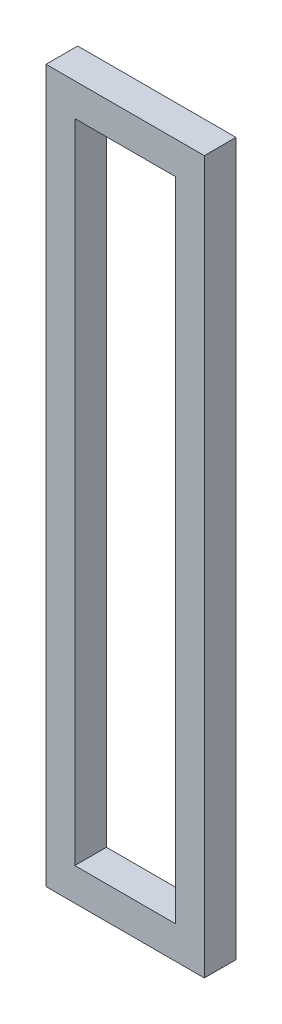
ISO-10303-21;
HEADER;
FILE_DESCRIPTION(('STEP AP214'),'2;1');
FILE_NAME('part.step','',(''),(''),'','','');
FILE_SCHEMA(('AUTOMOTIVE_DESIGN { 1 0 10303 214 1 1 1 1 }'));
ENDSEC;
DATA;
#1=APPLICATION_CONTEXT('core data for automotive mechanical design processes');
#2=APPLICATION_PROTOCOL_DEFINITION('international standard','automotive_design',2000,#1);
#3=PRODUCT_CONTEXT('',#1,'mechanical');
#4=PRODUCT('Part','Part','',(#3));
#5=PRODUCT_RELATED_PRODUCT_CATEGORY('part','',(#4));
#6=PRODUCT_DEFINITION_FORMATION('','',#4);
#7=PRODUCT_DEFINITION_CONTEXT('part definition',#1,'design');
#8=PRODUCT_DEFINITION('design','',#6,#7);
#9=PRODUCT_DEFINITION_SHAPE('','',#8);
#10=(LENGTH_UNIT() NAMED_UNIT(*) SI_UNIT(.MILLI.,.METRE.));
#11=(NAMED_UNIT(*) PLANE_ANGLE_UNIT() SI_UNIT($,.RADIAN.));
#12=(NAMED_UNIT(*) SI_UNIT($,.STERADIAN.) SOLID_ANGLE_UNIT());
#13=UNCERTAINTY_MEASURE_WITH_UNIT(LENGTH_MEASURE(1.E-05),#10,'distance_accuracy_value','');
#14=(GEOMETRIC_REPRESENTATION_CONTEXT(3) GLOBAL_UNCERTAINTY_ASSIGNED_CONTEXT((#13)) GLOBAL_UNIT_ASSIGNED_CONTEXT((#10,
#11,#12)) REPRESENTATION_CONTEXT('',''));
#15=CARTESIAN_POINT('',(0.,0.,0.));
#16=DIRECTION('',(0.,0.,1.));
#17=DIRECTION('',(1.,0.,0.));
#18=AXIS2_PLACEMENT_3D('',#15,#16,#17);
#19=CARTESIAN_POINT('',(50.,-225.,20.));
#20=DIRECTION('',(-1.,0.,0.));
#21=DIRECTION('',(0.,0.,1.));
#22=AXIS2_PLACEMENT_3D('',#19,#20,#21);
#23=PLANE('',#22);
#24=DIRECTION('',(0.,1.,0.));
#25=VECTOR('',#24,1.);
#26=CARTESIAN_POINT('',(50.,-225.,0.));
#27=LINE('',#26,#25);
#28=CARTESIAN_POINT('',(50.,-225.,0.));
#29=VERTEX_POINT('',#28);
#30=CARTESIAN_POINT('',(50.,225.,0.));
#31=VERTEX_POINT('',#30);
#32=EDGE_CURVE('E138',#29,#31,#27,.T.);
#33=ORIENTED_EDGE('',*,*,#32,.T.);
#34=DIRECTION('',(0.,0.,-1.));
#35=VECTOR('',#34,1.);
#36=CARTESIAN_POINT('',(50.,225.,20.));
#37=LINE('',#36,#35);
#38=CARTESIAN_POINT('',(50.,225.,20.));
#39=VERTEX_POINT('',#38);
#40=EDGE_CURVE('E180',#39,#31,#37,.T.);
#41=ORIENTED_EDGE('',*,*,#40,.F.);
#42=DIRECTION('',(0.,1.,0.));
#43=VECTOR('',#42,1.);
#44=CARTESIAN_POINT('',(50.,-225.,20.));
#45=LINE('',#44,#43);
#46=CARTESIAN_POINT('',(50.,-225.,20.));
#47=VERTEX_POINT('',#46);
#48=EDGE_CURVE('E143',#47,#39,#45,.T.);
#49=ORIENTED_EDGE('',*,*,#48,.F.);
#50=DIRECTION('',(0.,0.,-1.));
#51=VECTOR('',#50,1.);
#52=CARTESIAN_POINT('',(50.,-225.,20.));
#53=LINE('',#52,#51);
#54=EDGE_CURVE('E157',#47,#29,#53,.T.);
#55=ORIENTED_EDGE('',*,*,#54,.T.);
#56=EDGE_LOOP('',(#33,#41,#49,#55));
#57=FACE_BOUND('',#56,.T.);
#58=ADVANCED_FACE('F43',(#57),#23,.F.);
#59=CARTESIAN_POINT('',(-50.,225.,20.));
#60=DIRECTION('',(0.,-1.,0.));
#61=DIRECTION('',(0.,0.,-1.));
#62=AXIS2_PLACEMENT_3D('',#59,#60,#61);
#63=PLANE('',#62);
#64=DIRECTION('',(-1.,0.,0.));
#65=VECTOR('',#64,1.);
#66=CARTESIAN_POINT('',(-50.,225.,0.));
#67=LINE('',#66,#65);
#68=CARTESIAN_POINT('',(-50.,225.,0.));
#69=VERTEX_POINT('',#68);
#70=EDGE_CURVE('E161',#31,#69,#67,.T.);
#71=ORIENTED_EDGE('',*,*,#70,.T.);
#72=DIRECTION('',(0.,0.,-1.));
#73=VECTOR('',#72,1.);
#74=CARTESIAN_POINT('',(-50.,225.,20.));
#75=LINE('',#74,#73);
#76=CARTESIAN_POINT('',(-50.,225.,20.));
#77=VERTEX_POINT('',#76);
#78=EDGE_CURVE('E176',#77,#69,#75,.T.);
#79=ORIENTED_EDGE('',*,*,#78,.F.);
#80=DIRECTION('',(-1.,0.,0.));
#81=VECTOR('',#80,1.);
#82=CARTESIAN_POINT('',(-50.,225.,20.));
#83=LINE('',#82,#81);
#84=EDGE_CURVE('E147',#39,#77,#83,.T.);
#85=ORIENTED_EDGE('',*,*,#84,.F.);
#86=ORIENTED_EDGE('',*,*,#40,.T.);
#87=EDGE_LOOP('',(#71,#79,#85,#86));
#88=FACE_BOUND('',#87,.T.);
#89=ADVANCED_FACE('F210',(#88),#63,.F.);
#90=CARTESIAN_POINT('',(-50.,-225.,20.));
#91=DIRECTION('',(1.,0.,0.));
#92=DIRECTION('',(0.,0.,-1.));
#93=AXIS2_PLACEMENT_3D('',#90,#91,#92);
#94=PLANE('',#93);
#95=DIRECTION('',(0.,-1.,0.));
#96=VECTOR('',#95,1.);
#97=CARTESIAN_POINT('',(-50.,-225.,0.));
#98=LINE('',#97,#96);
#99=CARTESIAN_POINT('',(-50.,-225.,0.));
#100=VERTEX_POINT('',#99);
#101=EDGE_CURVE('E164',#69,#100,#98,.T.);
#102=ORIENTED_EDGE('',*,*,#101,.T.);
#103=DIRECTION('',(0.,0.,-1.));
#104=VECTOR('',#103,1.);
#105=CARTESIAN_POINT('',(-50.,-225.,20.));
#106=LINE('',#105,#104);
#107=CARTESIAN_POINT('',(-50.,-225.,20.));
#108=VERTEX_POINT('',#107);
#109=EDGE_CURVE('E172',#108,#100,#106,.T.);
#110=ORIENTED_EDGE('',*,*,#109,.F.);
#111=DIRECTION('',(0.,-1.,0.));
#112=VECTOR('',#111,1.);
#113=CARTESIAN_POINT('',(-50.,-225.,20.));
#114=LINE('',#113,#112);
#115=EDGE_CURVE('E151',#77,#108,#114,.T.);
#116=ORIENTED_EDGE('',*,*,#115,.F.);
#117=ORIENTED_EDGE('',*,*,#78,.T.);
#118=EDGE_LOOP('',(#102,#110,#116,#117));
#119=FACE_BOUND('',#118,.T.);
#120=ADVANCED_FACE('F215',(#119),#94,.F.);
#121=CARTESIAN_POINT('',(-50.,-225.,20.));
#122=DIRECTION('',(0.,1.,0.));
#123=DIRECTION('',(0.,0.,1.));
#124=AXIS2_PLACEMENT_3D('',#121,#122,#123);
#125=PLANE('',#124);
#126=DIRECTION('',(1.,0.,0.));
#127=VECTOR('',#126,1.);
#128=CARTESIAN_POINT('',(-50.,-225.,0.));
#129=LINE('',#128,#127);
#130=EDGE_CURVE('E148',#100,#29,#129,.T.);
#131=ORIENTED_EDGE('',*,*,#130,.T.);
#132=ORIENTED_EDGE('',*,*,#54,.F.);
#133=DIRECTION('',(1.,0.,0.));
#134=VECTOR('',#133,1.);
#135=CARTESIAN_POINT('',(-50.,-225.,20.));
#136=LINE('',#135,#134);
#137=EDGE_CURVE('E154',#108,#47,#136,.T.);
#138=ORIENTED_EDGE('',*,*,#137,.F.);
#139=ORIENTED_EDGE('',*,*,#109,.T.);
#140=EDGE_LOOP('',(#131,#132,#138,#139));
#141=FACE_BOUND('',#140,.T.);
#142=ADVANCED_FACE('F228',(#141),#125,.F.);
#143=CARTESIAN_POINT('',(0.,0.,20.));
#144=DIRECTION('',(0.,0.,-1.));
#145=DIRECTION('',(-1.,0.,0.));
#146=AXIS2_PLACEMENT_3D('',#143,#144,#145);
#147=PLANE('',#146);
#148=DIRECTION('',(-1.,0.,0.));
#149=VECTOR('',#148,1.);
#150=CARTESIAN_POINT('',(-31.8560131010251,204.409163615365,20.));
#151=LINE('',#150,#149);
#152=CARTESIAN_POINT('',(31.8560131010251,204.409163615365,20.));
#153=VERTEX_POINT('',#152);
#154=CARTESIAN_POINT('',(-31.8560131010251,204.409163615365,20.));
#155=VERTEX_POINT('',#154);
#156=EDGE_CURVE('E120',#153,#155,#151,.T.);
#157=ORIENTED_EDGE('',*,*,#156,.F.);
#158=DIRECTION('',(0.,1.,0.));
#159=VECTOR('',#158,1.);
#160=CARTESIAN_POINT('',(31.8560131010251,-204.409163615365,20.));
#161=LINE('',#160,#159);
#162=CARTESIAN_POINT('',(31.8560131010251,-204.409163615365,20.));
#163=VERTEX_POINT('',#162);
#164=EDGE_CURVE('E58',#163,#153,#161,.T.);
#165=ORIENTED_EDGE('',*,*,#164,.F.);
#166=DIRECTION('',(1.,0.,0.));
#167=VECTOR('',#166,1.);
#168=CARTESIAN_POINT('',(-31.8560131010251,-204.409163615365,20.));
#169=LINE('',#168,#167);
#170=CARTESIAN_POINT('',(-31.8560131010251,-204.409163615365,20.));
#171=VERTEX_POINT('',#170);
#172=EDGE_CURVE('E128',#171,#163,#169,.T.);
#173=ORIENTED_EDGE('',*,*,#172,.F.);
#174=DIRECTION('',(0.,-1.,0.));
#175=VECTOR('',#174,1.);
#176=CARTESIAN_POINT('',(-31.8560131010251,-204.409163615365,20.));
#177=LINE('',#176,#175);
#178=EDGE_CURVE('E110',#155,#171,#177,.T.);
#179=ORIENTED_EDGE('',*,*,#178,.F.);
#180=EDGE_LOOP('',(#157,#165,#173,#179));
#181=FACE_BOUND('',#180,.T.);
#182=ORIENTED_EDGE('',*,*,#48,.T.);
#183=ORIENTED_EDGE('',*,*,#84,.T.);
#184=ORIENTED_EDGE('',*,*,#115,.T.);
#185=ORIENTED_EDGE('',*,*,#137,.T.);
#186=EDGE_LOOP('',(#182,#183,#184,#185));
#187=FACE_BOUND('',#186,.T.);
#188=ADVANCED_FACE('F125',(#181,#187),#147,.F.);
#189=CARTESIAN_POINT('',(0.,0.,0.));
#190=DIRECTION('',(0.,0.,-1.));
#191=DIRECTION('',(-1.,0.,0.));
#192=AXIS2_PLACEMENT_3D('',#189,#190,#191);
#193=PLANE('',#192);
#194=DIRECTION('',(0.,-1.,0.));
#195=VECTOR('',#194,1.);
#196=CARTESIAN_POINT('',(31.8560131010251,0.,0.));
#197=LINE('',#196,#195);
#198=CARTESIAN_POINT('',(31.8560131010251,204.409163615365,0.));
#199=VERTEX_POINT('',#198);
#200=CARTESIAN_POINT('',(31.8560131010251,-204.409163615365,0.));
#201=VERTEX_POINT('',#200);
#202=EDGE_CURVE('E11',#199,#201,#197,.T.);
#203=ORIENTED_EDGE('',*,*,#202,.F.);
#204=DIRECTION('',(1.,0.,0.));
#205=VECTOR('',#204,1.);
#206=CARTESIAN_POINT('',(0.,204.409163615365,0.));
#207=LINE('',#206,#205);
#208=CARTESIAN_POINT('',(-31.8560131010251,204.409163615365,0.));
#209=VERTEX_POINT('',#208);
#210=EDGE_CURVE('E184',#209,#199,#207,.T.);
#211=ORIENTED_EDGE('',*,*,#210,.F.);
#212=DIRECTION('',(0.,1.,0.));
#213=VECTOR('',#212,1.);
#214=CARTESIAN_POINT('',(-31.8560131010251,0.,0.));
#215=LINE('',#214,#213);
#216=CARTESIAN_POINT('',(-31.8560131010251,-204.409163615365,0.));
#217=VERTEX_POINT('',#216);
#218=EDGE_CURVE('E113',#217,#209,#215,.T.);
#219=ORIENTED_EDGE('',*,*,#218,.F.);
#220=DIRECTION('',(-1.,0.,0.));
#221=VECTOR('',#220,1.);
#222=CARTESIAN_POINT('',(0.,-204.409163615365,0.));
#223=LINE('',#222,#221);
#224=EDGE_CURVE('E51',#201,#217,#223,.T.);
#225=ORIENTED_EDGE('',*,*,#224,.F.);
#226=EDGE_LOOP('',(#203,#211,#219,#225));
#227=FACE_BOUND('',#226,.T.);
#228=ORIENTED_EDGE('',*,*,#32,.F.);
#229=ORIENTED_EDGE('',*,*,#130,.F.);
#230=ORIENTED_EDGE('',*,*,#101,.F.);
#231=ORIENTED_EDGE('',*,*,#70,.F.);
#232=EDGE_LOOP('',(#228,#229,#230,#231));
#233=FACE_BOUND('',#232,.T.);
#234=ADVANCED_FACE('F195',(#227,#233),#193,.T.);
#235=CARTESIAN_POINT('',(31.8560131010251,-204.409163615365,-48.));
#236=DIRECTION('',(1.,0.,0.));
#237=DIRECTION('',(0.,0.,-1.));
#238=AXIS2_PLACEMENT_3D('',#235,#236,#237);
#239=PLANE('',#238);
#240=ORIENTED_EDGE('',*,*,#202,.T.);
#241=DIRECTION('',(0.,0.,1.));
#242=VECTOR('',#241,1.);
#243=CARTESIAN_POINT('',(31.8560131010251,-204.409163615365,-48.));
#244=LINE('',#243,#242);
#245=EDGE_CURVE('E135',#201,#163,#244,.T.);
#246=ORIENTED_EDGE('',*,*,#245,.T.);
#247=ORIENTED_EDGE('',*,*,#164,.T.);
#248=DIRECTION('',(0.,0.,1.));
#249=VECTOR('',#248,1.);
#250=CARTESIAN_POINT('',(31.8560131010251,204.409163615365,-48.));
#251=LINE('',#250,#249);
#252=EDGE_CURVE('E117',#199,#153,#251,.T.);
#253=ORIENTED_EDGE('',*,*,#252,.F.);
#254=EDGE_LOOP('',(#240,#246,#247,#253));
#255=FACE_BOUND('',#254,.T.);
#256=ADVANCED_FACE('F197',(#255),#239,.F.);
#257=CARTESIAN_POINT('',(-31.8560131010251,-204.409163615365,-48.));
#258=DIRECTION('',(0.,-1.,0.));
#259=DIRECTION('',(0.,0.,-1.));
#260=AXIS2_PLACEMENT_3D('',#257,#258,#259);
#261=PLANE('',#260);
#262=ORIENTED_EDGE('',*,*,#224,.T.);
#263=DIRECTION('',(0.,0.,1.));
#264=VECTOR('',#263,1.);
#265=CARTESIAN_POINT('',(-31.8560131010251,-204.409163615365,-48.));
#266=LINE('',#265,#264);
#267=EDGE_CURVE('E116',#217,#171,#266,.T.);
#268=ORIENTED_EDGE('',*,*,#267,.T.);
#269=ORIENTED_EDGE('',*,*,#172,.T.);
#270=ORIENTED_EDGE('',*,*,#245,.F.);
#271=EDGE_LOOP('',(#262,#268,#269,#270));
#272=FACE_BOUND('',#271,.T.);
#273=ADVANCED_FACE('F192',(#272),#261,.F.);
#274=CARTESIAN_POINT('',(-31.8560131010251,-204.409163615365,-48.));
#275=DIRECTION('',(-1.,0.,0.));
#276=DIRECTION('',(0.,0.,1.));
#277=AXIS2_PLACEMENT_3D('',#274,#275,#276);
#278=PLANE('',#277);
#279=ORIENTED_EDGE('',*,*,#218,.T.);
#280=DIRECTION('',(0.,0.,1.));
#281=VECTOR('',#280,1.);
#282=CARTESIAN_POINT('',(-31.8560131010251,204.409163615365,-48.));
#283=LINE('',#282,#281);
#284=EDGE_CURVE('E66',#209,#155,#283,.T.);
#285=ORIENTED_EDGE('',*,*,#284,.T.);
#286=ORIENTED_EDGE('',*,*,#178,.T.);
#287=ORIENTED_EDGE('',*,*,#267,.F.);
#288=EDGE_LOOP('',(#279,#285,#286,#287));
#289=FACE_BOUND('',#288,.T.);
#290=ADVANCED_FACE('F107',(#289),#278,.F.);
#291=CARTESIAN_POINT('',(-31.8560131010251,204.409163615365,-48.));
#292=DIRECTION('',(0.,1.,0.));
#293=DIRECTION('',(0.,0.,1.));
#294=AXIS2_PLACEMENT_3D('',#291,#292,#293);
#295=PLANE('',#294);
#296=ORIENTED_EDGE('',*,*,#210,.T.);
#297=ORIENTED_EDGE('',*,*,#252,.T.);
#298=ORIENTED_EDGE('',*,*,#156,.T.);
#299=ORIENTED_EDGE('',*,*,#284,.F.);
#300=EDGE_LOOP('',(#296,#297,#298,#299));
#301=FACE_BOUND('',#300,.T.);
#302=ADVANCED_FACE('F121',(#301),#295,.F.);
#303=CLOSED_SHELL('',(#58,#89,#120,#142,#188,#234,#256,#273,#290,#302));
#304=MANIFOLD_SOLID_BREP('B2',#303);
#305=ADVANCED_BREP_SHAPE_REPRESENTATION('',(#18,#304),#14);
#306=SHAPE_DEFINITION_REPRESENTATION(#9,#305);
ENDSEC;
END-ISO-10303-21;
